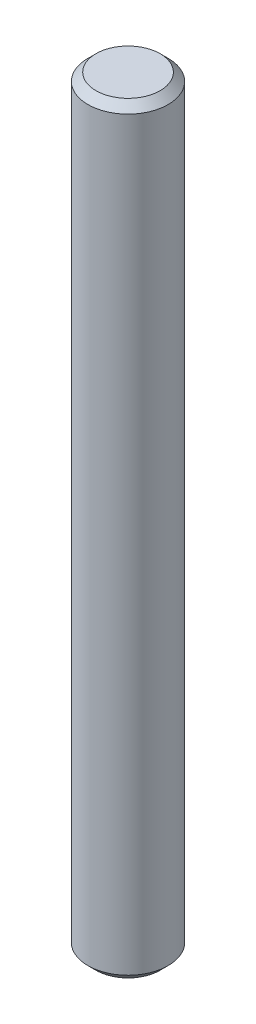
ISO-10303-21;
HEADER;
FILE_DESCRIPTION(('STEP AP214'),'2;1');
FILE_NAME('part.step','',(''),(''),'','','');
FILE_SCHEMA(('AUTOMOTIVE_DESIGN { 1 0 10303 214 1 1 1 1 }'));
ENDSEC;
DATA;
#1=APPLICATION_CONTEXT('core data for automotive mechanical design processes');
#2=APPLICATION_PROTOCOL_DEFINITION('international standard','automotive_design',2000,#1);
#3=PRODUCT_CONTEXT('',#1,'mechanical');
#4=PRODUCT('Part','Part','',(#3));
#5=PRODUCT_RELATED_PRODUCT_CATEGORY('part','',(#4));
#6=PRODUCT_DEFINITION_FORMATION('','',#4);
#7=PRODUCT_DEFINITION_CONTEXT('part definition',#1,'design');
#8=PRODUCT_DEFINITION('design','',#6,#7);
#9=PRODUCT_DEFINITION_SHAPE('','',#8);
#10=(LENGTH_UNIT() NAMED_UNIT(*) SI_UNIT(.MILLI.,.METRE.));
#11=(NAMED_UNIT(*) PLANE_ANGLE_UNIT() SI_UNIT($,.RADIAN.));
#12=(NAMED_UNIT(*) SI_UNIT($,.STERADIAN.) SOLID_ANGLE_UNIT());
#13=UNCERTAINTY_MEASURE_WITH_UNIT(LENGTH_MEASURE(1.E-05),#10,'distance_accuracy_value','');
#14=(GEOMETRIC_REPRESENTATION_CONTEXT(3) GLOBAL_UNCERTAINTY_ASSIGNED_CONTEXT((#13)) GLOBAL_UNIT_ASSIGNED_CONTEXT((#10,
#11,#12)) REPRESENTATION_CONTEXT('',''));
#15=CARTESIAN_POINT('',(0.,0.,0.));
#16=DIRECTION('',(0.,0.,1.));
#17=DIRECTION('',(1.,0.,0.));
#18=AXIS2_PLACEMENT_3D('',#15,#16,#17);
#19=CARTESIAN_POINT('',(0.,100.,0.));
#20=DIRECTION('',(0.,-1.,0.));
#21=DIRECTION('',(1.,0.,0.));
#22=AXIS2_PLACEMENT_3D('',#19,#20,#21);
#23=PLANE('',#22);
#24=CARTESIAN_POINT('',(0.,100.,0.));
#25=DIRECTION('',(0.,-1.,0.));
#26=DIRECTION('',(1.,0.,0.));
#27=AXIS2_PLACEMENT_3D('',#24,#25,#26);
#28=CIRCLE('',#27,3.99999999999998);
#29=CARTESIAN_POINT('',(3.99999999999998,100.,0.));
#30=VERTEX_POINT('',#29);
#31=EDGE_CURVE('E10',#30,#30,#28,.F.);
#32=ORIENTED_EDGE('',*,*,#31,.T.);
#33=EDGE_LOOP('',(#32));
#34=FACE_BOUND('',#33,.T.);
#35=ADVANCED_FACE('F34',(#34),#23,.F.);
#36=CARTESIAN_POINT('',(0.,100.,0.));
#37=DIRECTION('',(0.,-1.,0.));
#38=DIRECTION('',(0.,0.,-1.));
#39=AXIS2_PLACEMENT_3D('',#36,#37,#38);
#40=CYLINDRICAL_SURFACE('',#39,5.);
#41=CARTESIAN_POINT('',(0.,5.99999999999999,0.));
#42=DIRECTION('',(0.,-1.,0.));
#43=DIRECTION('',(0.,0.,-1.));
#44=AXIS2_PLACEMENT_3D('',#41,#42,#43);
#45=CIRCLE('',#44,5.);
#46=CARTESIAN_POINT('',(0.,5.99999999999999,-5.));
#47=VERTEX_POINT('',#46);
#48=EDGE_CURVE('E45',#47,#47,#45,.F.);
#49=ORIENTED_EDGE('',*,*,#48,.T.);
#50=EDGE_LOOP('',(#49));
#51=FACE_BOUND('',#50,.T.);
#52=CARTESIAN_POINT('',(0.,99.,0.));
#53=DIRECTION('',(0.,-1.,0.));
#54=DIRECTION('',(0.,0.,-1.));
#55=AXIS2_PLACEMENT_3D('',#52,#53,#54);
#56=CIRCLE('',#55,5.);
#57=CARTESIAN_POINT('',(0.,99.,-5.));
#58=VERTEX_POINT('',#57);
#59=EDGE_CURVE('E49',#58,#58,#56,.T.);
#60=ORIENTED_EDGE('',*,*,#59,.T.);
#61=EDGE_LOOP('',(#60));
#62=FACE_BOUND('',#61,.T.);
#63=ADVANCED_FACE('F55',(#51,#62),#40,.T.);
#64=CARTESIAN_POINT('',(0.,5.,0.));
#65=DIRECTION('',(0.,-1.,0.));
#66=DIRECTION('',(0.,0.,-1.));
#67=AXIS2_PLACEMENT_3D('',#64,#65,#66);
#68=PLANE('',#67);
#69=CARTESIAN_POINT('',(0.,5.,0.));
#70=DIRECTION('',(0.,-1.,0.));
#71=DIRECTION('',(0.,0.,-1.));
#72=AXIS2_PLACEMENT_3D('',#69,#70,#71);
#73=CIRCLE('',#72,4.);
#74=CARTESIAN_POINT('',(0.,5.,-4.));
#75=VERTEX_POINT('',#74);
#76=EDGE_CURVE('E41',#75,#75,#73,.T.);
#77=ORIENTED_EDGE('',*,*,#76,.T.);
#78=EDGE_LOOP('',(#77));
#79=FACE_BOUND('',#78,.T.);
#80=ADVANCED_FACE('F63',(#79),#68,.T.);
#81=CARTESIAN_POINT('',(0.,5.99999999999999,0.));
#82=DIRECTION('',(0.,1.,0.));
#83=DIRECTION('',(0.,0.,1.));
#84=AXIS2_PLACEMENT_3D('',#81,#82,#83);
#85=CONICAL_SURFACE('',#84,5.,0.785398163397453);
#86=ORIENTED_EDGE('',*,*,#76,.F.);
#87=EDGE_LOOP('',(#86));
#88=FACE_BOUND('',#87,.T.);
#89=ORIENTED_EDGE('',*,*,#48,.F.);
#90=EDGE_LOOP('',(#89));
#91=FACE_BOUND('',#90,.T.);
#92=ADVANCED_FACE('F58',(#88,#91),#85,.T.);
#93=CARTESIAN_POINT('',(0.,99.,0.));
#94=DIRECTION('',(0.,-1.,0.));
#95=DIRECTION('',(0.,0.,-1.));
#96=AXIS2_PLACEMENT_3D('',#93,#94,#95);
#97=CONICAL_SURFACE('',#96,5.,0.785398163397446);
#98=ORIENTED_EDGE('',*,*,#31,.F.);
#99=EDGE_LOOP('',(#98));
#100=FACE_BOUND('',#99,.T.);
#101=ORIENTED_EDGE('',*,*,#59,.F.);
#102=EDGE_LOOP('',(#101));
#103=FACE_BOUND('',#102,.T.);
#104=ADVANCED_FACE('F36',(#100,#103),#97,.T.);
#105=CLOSED_SHELL('',(#35,#63,#80,#92,#104));
#106=MANIFOLD_SOLID_BREP('B2',#105);
#107=ADVANCED_BREP_SHAPE_REPRESENTATION('',(#18,#106),#14);
#108=SHAPE_DEFINITION_REPRESENTATION(#9,#107);
ENDSEC;
END-ISO-10303-21;
